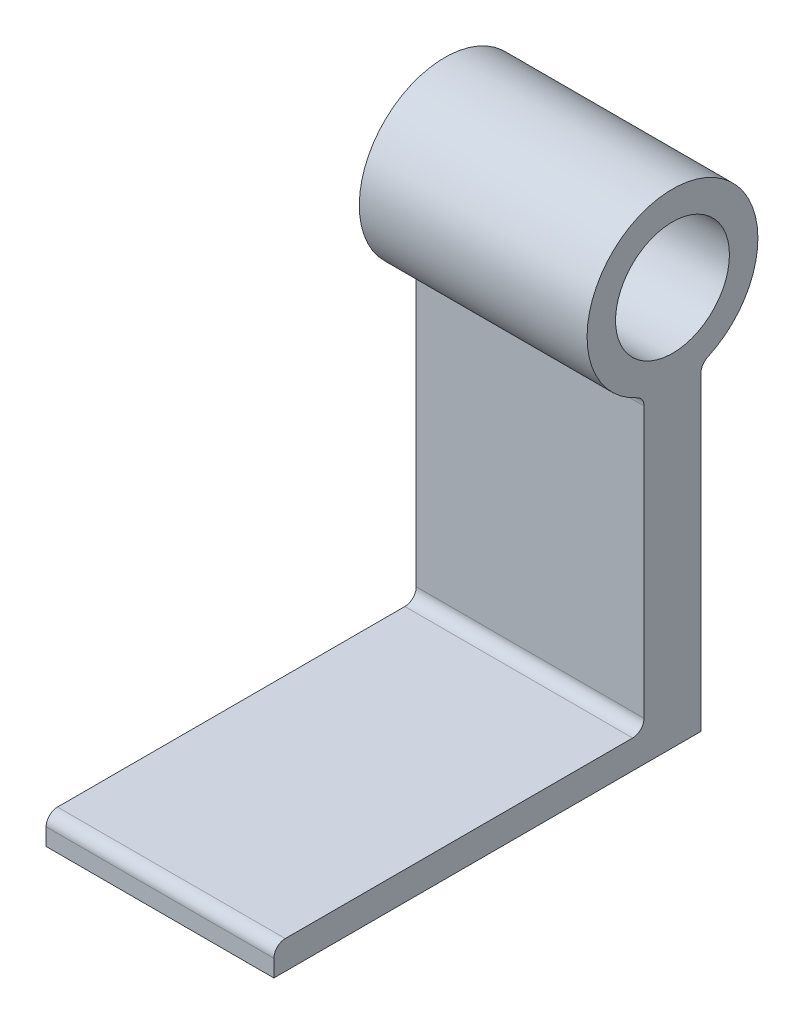
ISO-10303-21;
HEADER;
FILE_DESCRIPTION(('STEP AP214'),'2;1');
FILE_NAME('part.step','',(''),(''),'','','');
FILE_SCHEMA(('AUTOMOTIVE_DESIGN { 1 0 10303 214 1 1 1 1 }'));
ENDSEC;
DATA;
#1=APPLICATION_CONTEXT('core data for automotive mechanical design processes');
#2=APPLICATION_PROTOCOL_DEFINITION('international standard','automotive_design',2000,#1);
#3=PRODUCT_CONTEXT('',#1,'mechanical');
#4=PRODUCT('Part','Part','',(#3));
#5=PRODUCT_RELATED_PRODUCT_CATEGORY('part','',(#4));
#6=PRODUCT_DEFINITION_FORMATION('','',#4);
#7=PRODUCT_DEFINITION_CONTEXT('part definition',#1,'design');
#8=PRODUCT_DEFINITION('design','',#6,#7);
#9=PRODUCT_DEFINITION_SHAPE('','',#8);
#10=(LENGTH_UNIT() NAMED_UNIT(*) SI_UNIT(.MILLI.,.METRE.));
#11=(NAMED_UNIT(*) PLANE_ANGLE_UNIT() SI_UNIT($,.RADIAN.));
#12=(NAMED_UNIT(*) SI_UNIT($,.STERADIAN.) SOLID_ANGLE_UNIT());
#13=UNCERTAINTY_MEASURE_WITH_UNIT(LENGTH_MEASURE(1.E-05),#10,'distance_accuracy_value','');
#14=(GEOMETRIC_REPRESENTATION_CONTEXT(3) GLOBAL_UNCERTAINTY_ASSIGNED_CONTEXT((#13)) GLOBAL_UNIT_ASSIGNED_CONTEXT((#10,
#11,#12)) REPRESENTATION_CONTEXT('',''));
#15=CARTESIAN_POINT('',(0.,0.,0.));
#16=DIRECTION('',(0.,0.,1.));
#17=DIRECTION('',(1.,0.,0.));
#18=AXIS2_PLACEMENT_3D('',#15,#16,#17);
#19=CARTESIAN_POINT('',(50.8,0.,0.));
#20=DIRECTION('',(0.,0.,-1.));
#21=DIRECTION('',(0.,1.,0.));
#22=AXIS2_PLACEMENT_3D('',#19,#20,#21);
#23=PLANE('',#22);
#24=DIRECTION('',(0.,-1.,0.));
#25=VECTOR('',#24,1.);
#26=CARTESIAN_POINT('',(0.,0.,0.));
#27=LINE('',#26,#25);
#28=CARTESIAN_POINT('',(0.,69.2252446012663,0.));
#29=VERTEX_POINT('',#28);
#30=CARTESIAN_POINT('',(0.,0.,0.));
#31=VERTEX_POINT('',#30);
#32=EDGE_CURVE('E145',#29,#31,#27,.T.);
#33=ORIENTED_EDGE('',*,*,#32,.F.);
#34=DIRECTION('',(-1.,0.,0.));
#35=VECTOR('',#34,1.);
#36=CARTESIAN_POINT('',(50.8,69.2252446012663,0.));
#37=LINE('',#36,#35);
#38=CARTESIAN_POINT('',(50.8,69.2252446012663,0.));
#39=VERTEX_POINT('',#38);
#40=EDGE_CURVE('E175',#29,#39,#37,.F.);
#41=ORIENTED_EDGE('',*,*,#40,.T.);
#42=DIRECTION('',(0.,-1.,0.));
#43=VECTOR('',#42,1.);
#44=CARTESIAN_POINT('',(50.8,0.,0.));
#45=LINE('',#44,#43);
#46=CARTESIAN_POINT('',(50.8,0.,0.));
#47=VERTEX_POINT('',#46);
#48=EDGE_CURVE('E161',#39,#47,#45,.T.);
#49=ORIENTED_EDGE('',*,*,#48,.T.);
#50=DIRECTION('',(-1.,0.,0.));
#51=VECTOR('',#50,1.);
#52=CARTESIAN_POINT('',(50.8,0.,0.));
#53=LINE('',#52,#51);
#54=EDGE_CURVE('E125',#47,#31,#53,.T.);
#55=ORIENTED_EDGE('',*,*,#54,.T.);
#56=EDGE_LOOP('',(#33,#41,#49,#55));
#57=FACE_BOUND('',#56,.T.);
#58=ADVANCED_FACE('F38',(#57),#23,.T.);
#59=CARTESIAN_POINT('',(50.8,88.9,6.35));
#60=DIRECTION('',(-1.,0.,0.));
#61=DIRECTION('',(0.,0.,1.));
#62=AXIS2_PLACEMENT_3D('',#59,#60,#61);
#63=CYLINDRICAL_SURFACE('',#62,19.05);
#64=CARTESIAN_POINT('',(50.8,88.9,6.35));
#65=DIRECTION('',(1.,0.,0.));
#66=DIRECTION('',(0.,0.,-1.));
#67=AXIS2_PLACEMENT_3D('',#64,#65,#66);
#68=CIRCLE('',#67,19.05);
#69=CARTESIAN_POINT('',(50.8,71.5399217069997,-1.49411764705882));
#70=VERTEX_POINT('',#69);
#71=CARTESIAN_POINT('',(50.8,71.5399217069997,14.1941176470588));
#72=VERTEX_POINT('',#71);
#73=EDGE_CURVE('E200',#70,#72,#68,.T.);
#74=ORIENTED_EDGE('',*,*,#73,.F.);
#75=DIRECTION('',(-1.,0.,0.));
#76=VECTOR('',#75,1.);
#77=CARTESIAN_POINT('',(50.8,71.5399217069997,-1.49411764705882));
#78=LINE('',#77,#76);
#79=CARTESIAN_POINT('',(0.,71.5399217069997,-1.49411764705882));
#80=VERTEX_POINT('',#79);
#81=EDGE_CURVE('E172',#70,#80,#78,.T.);
#82=ORIENTED_EDGE('',*,*,#81,.T.);
#83=CARTESIAN_POINT('',(0.,88.9,6.35));
#84=DIRECTION('',(1.,0.,0.));
#85=DIRECTION('',(0.,0.,-1.));
#86=AXIS2_PLACEMENT_3D('',#83,#84,#85);
#87=CIRCLE('',#86,19.05);
#88=CARTESIAN_POINT('',(0.,71.5399217069997,14.1941176470588));
#89=VERTEX_POINT('',#88);
#90=EDGE_CURVE('E147',#80,#89,#87,.T.);
#91=ORIENTED_EDGE('',*,*,#90,.T.);
#92=DIRECTION('',(-1.,0.,0.));
#93=VECTOR('',#92,1.);
#94=CARTESIAN_POINT('',(50.8,71.5399217069997,14.1941176470588));
#95=LINE('',#94,#93);
#96=EDGE_CURVE('E170',#89,#72,#95,.F.);
#97=ORIENTED_EDGE('',*,*,#96,.T.);
#98=EDGE_LOOP('',(#74,#82,#91,#97));
#99=FACE_BOUND('',#98,.T.);
#100=ADVANCED_FACE('F225',(#99),#63,.T.);
#101=CARTESIAN_POINT('',(50.8,0.,12.7));
#102=DIRECTION('',(0.,0.,1.));
#103=DIRECTION('',(1.,0.,0.));
#104=AXIS2_PLACEMENT_3D('',#101,#102,#103);
#105=PLANE('',#104);
#106=DIRECTION('',(0.,1.,0.));
#107=VECTOR('',#106,1.);
#108=CARTESIAN_POINT('',(0.,0.,12.7));
#109=LINE('',#108,#107);
#110=CARTESIAN_POINT('',(0.,8.88999999999999,12.7));
#111=VERTEX_POINT('',#110);
#112=CARTESIAN_POINT('',(0.,69.2252446012663,12.7));
#113=VERTEX_POINT('',#112);
#114=EDGE_CURVE('E150',#111,#113,#109,.T.);
#115=ORIENTED_EDGE('',*,*,#114,.F.);
#116=DIRECTION('',(-1.,0.,0.));
#117=VECTOR('',#116,1.);
#118=CARTESIAN_POINT('',(50.8,8.88999999999999,12.7));
#119=LINE('',#118,#117);
#120=CARTESIAN_POINT('',(50.8,8.88999999999999,12.7));
#121=VERTEX_POINT('',#120);
#122=EDGE_CURVE('E168',#111,#121,#119,.F.);
#123=ORIENTED_EDGE('',*,*,#122,.T.);
#124=DIRECTION('',(0.,1.,0.));
#125=VECTOR('',#124,1.);
#126=CARTESIAN_POINT('',(50.8,0.,12.7));
#127=LINE('',#126,#125);
#128=CARTESIAN_POINT('',(50.8,69.2252446012663,12.7));
#129=VERTEX_POINT('',#128);
#130=EDGE_CURVE('E203',#121,#129,#127,.T.);
#131=ORIENTED_EDGE('',*,*,#130,.T.);
#132=DIRECTION('',(-1.,0.,0.));
#133=VECTOR('',#132,1.);
#134=CARTESIAN_POINT('',(50.8,69.2252446012663,12.7));
#135=LINE('',#134,#133);
#136=EDGE_CURVE('E165',#129,#113,#135,.T.);
#137=ORIENTED_EDGE('',*,*,#136,.T.);
#138=EDGE_LOOP('',(#115,#123,#131,#137));
#139=FACE_BOUND('',#138,.T.);
#140=ADVANCED_FACE('F217',(#139),#105,.T.);
#141=CARTESIAN_POINT('',(50.8,6.34999999999999,0.));
#142=DIRECTION('',(0.,1.,0.));
#143=DIRECTION('',(0.,0.,1.));
#144=AXIS2_PLACEMENT_3D('',#141,#142,#143);
#145=PLANE('',#144);
#146=DIRECTION('',(0.,0.,-1.));
#147=VECTOR('',#146,1.);
#148=CARTESIAN_POINT('',(0.,6.34999999999999,0.));
#149=LINE('',#148,#147);
#150=CARTESIAN_POINT('',(0.,6.34999999999999,92.71));
#151=VERTEX_POINT('',#150);
#152=CARTESIAN_POINT('',(0.,6.34999999999999,15.24));
#153=VERTEX_POINT('',#152);
#154=EDGE_CURVE('E153',#151,#153,#149,.T.);
#155=ORIENTED_EDGE('',*,*,#154,.F.);
#156=DIRECTION('',(-1.,0.,0.));
#157=VECTOR('',#156,1.);
#158=CARTESIAN_POINT('',(50.8,6.34999999999999,92.71));
#159=LINE('',#158,#157);
#160=CARTESIAN_POINT('',(50.8,6.34999999999999,92.71));
#161=VERTEX_POINT('',#160);
#162=EDGE_CURVE('E46',#151,#161,#159,.F.);
#163=ORIENTED_EDGE('',*,*,#162,.T.);
#164=DIRECTION('',(0.,0.,-1.));
#165=VECTOR('',#164,1.);
#166=CARTESIAN_POINT('',(50.8,6.34999999999999,0.));
#167=LINE('',#166,#165);
#168=CARTESIAN_POINT('',(50.8,6.34999999999999,15.24));
#169=VERTEX_POINT('',#168);
#170=EDGE_CURVE('E134',#161,#169,#167,.T.);
#171=ORIENTED_EDGE('',*,*,#170,.T.);
#172=DIRECTION('',(-1.,0.,0.));
#173=VECTOR('',#172,1.);
#174=CARTESIAN_POINT('',(0.,6.34999999999999,15.24));
#175=LINE('',#174,#173);
#176=EDGE_CURVE('E124',#169,#153,#175,.T.);
#177=ORIENTED_EDGE('',*,*,#176,.T.);
#178=EDGE_LOOP('',(#155,#163,#171,#177));
#179=FACE_BOUND('',#178,.T.);
#180=ADVANCED_FACE('F207',(#179),#145,.T.);
#181=CARTESIAN_POINT('',(50.8,0.,95.25));
#182=DIRECTION('',(0.,0.,1.));
#183=DIRECTION('',(1.,0.,0.));
#184=AXIS2_PLACEMENT_3D('',#181,#182,#183);
#185=PLANE('',#184);
#186=DIRECTION('',(0.,1.,0.));
#187=VECTOR('',#186,1.);
#188=CARTESIAN_POINT('',(50.8,0.,95.25));
#189=LINE('',#188,#187);
#190=CARTESIAN_POINT('',(50.8,0.,95.25));
#191=VERTEX_POINT('',#190);
#192=CARTESIAN_POINT('',(50.8,3.80999999999999,95.25));
#193=VERTEX_POINT('',#192);
#194=EDGE_CURVE('E117',#191,#193,#189,.T.);
#195=ORIENTED_EDGE('',*,*,#194,.T.);
#196=DIRECTION('',(-1.,0.,0.));
#197=VECTOR('',#196,1.);
#198=CARTESIAN_POINT('',(50.8,3.80999999999999,95.25));
#199=LINE('',#198,#197);
#200=CARTESIAN_POINT('',(0.,3.80999999999999,95.25));
#201=VERTEX_POINT('',#200);
#202=EDGE_CURVE('E190',#193,#201,#199,.T.);
#203=ORIENTED_EDGE('',*,*,#202,.T.);
#204=DIRECTION('',(0.,1.,0.));
#205=VECTOR('',#204,1.);
#206=CARTESIAN_POINT('',(0.,0.,95.25));
#207=LINE('',#206,#205);
#208=CARTESIAN_POINT('',(0.,0.,95.25));
#209=VERTEX_POINT('',#208);
#210=EDGE_CURVE('E119',#209,#201,#207,.T.);
#211=ORIENTED_EDGE('',*,*,#210,.F.);
#212=DIRECTION('',(-1.,0.,0.));
#213=VECTOR('',#212,1.);
#214=CARTESIAN_POINT('',(50.8,0.,95.25));
#215=LINE('',#214,#213);
#216=EDGE_CURVE('E113',#191,#209,#215,.T.);
#217=ORIENTED_EDGE('',*,*,#216,.F.);
#218=EDGE_LOOP('',(#195,#203,#211,#217));
#219=FACE_BOUND('',#218,.T.);
#220=ADVANCED_FACE('F115',(#219),#185,.T.);
#221=CARTESIAN_POINT('',(50.8,0.,0.));
#222=DIRECTION('',(0.,-1.,0.));
#223=DIRECTION('',(0.,0.,-1.));
#224=AXIS2_PLACEMENT_3D('',#221,#222,#223);
#225=PLANE('',#224);
#226=DIRECTION('',(0.,0.,1.));
#227=VECTOR('',#226,1.);
#228=CARTESIAN_POINT('',(0.,0.,0.));
#229=LINE('',#228,#227);
#230=EDGE_CURVE('E156',#31,#209,#229,.T.);
#231=ORIENTED_EDGE('',*,*,#230,.F.);
#232=ORIENTED_EDGE('',*,*,#54,.F.);
#233=DIRECTION('',(0.,0.,1.));
#234=VECTOR('',#233,1.);
#235=CARTESIAN_POINT('',(50.8,0.,0.));
#236=LINE('',#235,#234);
#237=EDGE_CURVE('E132',#47,#191,#236,.T.);
#238=ORIENTED_EDGE('',*,*,#237,.T.);
#239=ORIENTED_EDGE('',*,*,#216,.T.);
#240=EDGE_LOOP('',(#231,#232,#238,#239));
#241=FACE_BOUND('',#240,.T.);
#242=ADVANCED_FACE('F137',(#241),#225,.T.);
#243=CARTESIAN_POINT('',(50.8,88.9,6.35));
#244=DIRECTION('',(-1.,0.,0.));
#245=DIRECTION('',(0.,0.,1.));
#246=AXIS2_PLACEMENT_3D('',#243,#244,#245);
#247=CYLINDRICAL_SURFACE('',#246,12.7);
#248=CARTESIAN_POINT('',(50.8,88.9,6.35));
#249=DIRECTION('',(1.,0.,0.));
#250=DIRECTION('',(0.,0.,-1.));
#251=AXIS2_PLACEMENT_3D('',#248,#249,#250);
#252=CIRCLE('',#251,12.7);
#253=CARTESIAN_POINT('',(50.8,88.9,-6.35));
#254=VERTEX_POINT('',#253);
#255=EDGE_CURVE('E139',#254,#254,#252,.T.);
#256=ORIENTED_EDGE('',*,*,#255,.T.);
#257=EDGE_LOOP('',(#256));
#258=FACE_BOUND('',#257,.T.);
#259=CARTESIAN_POINT('',(0.,88.9,6.35));
#260=DIRECTION('',(1.,0.,0.));
#261=DIRECTION('',(0.,0.,-1.));
#262=AXIS2_PLACEMENT_3D('',#259,#260,#261);
#263=CIRCLE('',#262,12.7);
#264=CARTESIAN_POINT('',(0.,88.9,-6.35));
#265=VERTEX_POINT('',#264);
#266=EDGE_CURVE('E158',#265,#265,#263,.T.);
#267=ORIENTED_EDGE('',*,*,#266,.F.);
#268=EDGE_LOOP('',(#267));
#269=FACE_BOUND('',#268,.T.);
#270=ADVANCED_FACE('F251',(#258,#269),#247,.F.);
#271=CARTESIAN_POINT('',(50.8,0.,0.));
#272=DIRECTION('',(1.,0.,0.));
#273=DIRECTION('',(0.,0.,-1.));
#274=AXIS2_PLACEMENT_3D('',#271,#272,#273);
#275=PLANE('',#274);
#276=ORIENTED_EDGE('',*,*,#170,.F.);
#277=CARTESIAN_POINT('',(50.8,3.80999999999999,92.71));
#278=DIRECTION('',(1.,0.,0.));
#279=DIRECTION('',(0.,0.,-1.));
#280=AXIS2_PLACEMENT_3D('',#277,#278,#279);
#281=CIRCLE('',#280,2.54);
#282=EDGE_CURVE('E11',#161,#193,#281,.T.);
#283=ORIENTED_EDGE('',*,*,#282,.T.);
#284=ORIENTED_EDGE('',*,*,#194,.F.);
#285=ORIENTED_EDGE('',*,*,#237,.F.);
#286=ORIENTED_EDGE('',*,*,#48,.F.);
#287=CARTESIAN_POINT('',(50.8,69.2252446012663,-2.54));
#288=DIRECTION('',(1.,0.,0.));
#289=DIRECTION('',(0.,0.,-1.));
#290=AXIS2_PLACEMENT_3D('',#287,#288,#289);
#291=CIRCLE('',#290,2.54);
#292=EDGE_CURVE('E184',#39,#70,#291,.F.);
#293=ORIENTED_EDGE('',*,*,#292,.T.);
#294=ORIENTED_EDGE('',*,*,#73,.T.);
#295=CARTESIAN_POINT('',(50.8,69.2252446012663,15.24));
#296=DIRECTION('',(1.,0.,0.));
#297=DIRECTION('',(0.,0.,-1.));
#298=AXIS2_PLACEMENT_3D('',#295,#296,#297);
#299=CIRCLE('',#298,2.54);
#300=EDGE_CURVE('E188',#72,#129,#299,.F.);
#301=ORIENTED_EDGE('',*,*,#300,.T.);
#302=ORIENTED_EDGE('',*,*,#130,.F.);
#303=CARTESIAN_POINT('',(50.8,8.88999999999999,15.24));
#304=DIRECTION('',(1.,0.,0.));
#305=DIRECTION('',(0.,0.,-1.));
#306=AXIS2_PLACEMENT_3D('',#303,#304,#305);
#307=CIRCLE('',#306,2.54);
#308=EDGE_CURVE('E179',#121,#169,#307,.F.);
#309=ORIENTED_EDGE('',*,*,#308,.T.);
#310=EDGE_LOOP('',(#276,#283,#284,#285,#286,#293,#294,#301,#302,#309));
#311=FACE_BOUND('',#310,.T.);
#312=ORIENTED_EDGE('',*,*,#255,.F.);
#313=EDGE_LOOP('',(#312));
#314=FACE_BOUND('',#313,.T.);
#315=ADVANCED_FACE('F129',(#311,#314),#275,.T.);
#316=CARTESIAN_POINT('',(0.,0.,0.));
#317=DIRECTION('',(1.,0.,0.));
#318=DIRECTION('',(0.,0.,-1.));
#319=AXIS2_PLACEMENT_3D('',#316,#317,#318);
#320=PLANE('',#319);
#321=ORIENTED_EDGE('',*,*,#210,.T.);
#322=CARTESIAN_POINT('',(0.,3.80999999999999,92.71));
#323=DIRECTION('',(1.,0.,0.));
#324=DIRECTION('',(0.,0.,-1.));
#325=AXIS2_PLACEMENT_3D('',#322,#323,#324);
#326=CIRCLE('',#325,2.54);
#327=EDGE_CURVE('E60',#201,#151,#326,.F.);
#328=ORIENTED_EDGE('',*,*,#327,.T.);
#329=ORIENTED_EDGE('',*,*,#154,.T.);
#330=CARTESIAN_POINT('',(0.,8.88999999999999,15.24));
#331=DIRECTION('',(1.,0.,0.));
#332=DIRECTION('',(0.,0.,-1.));
#333=AXIS2_PLACEMENT_3D('',#330,#331,#332);
#334=CIRCLE('',#333,2.54);
#335=EDGE_CURVE('E177',#153,#111,#334,.T.);
#336=ORIENTED_EDGE('',*,*,#335,.T.);
#337=ORIENTED_EDGE('',*,*,#114,.T.);
#338=CARTESIAN_POINT('',(0.,69.2252446012663,15.24));
#339=DIRECTION('',(1.,0.,0.));
#340=DIRECTION('',(0.,0.,-1.));
#341=AXIS2_PLACEMENT_3D('',#338,#339,#340);
#342=CIRCLE('',#341,2.54);
#343=EDGE_CURVE('E186',#113,#89,#342,.T.);
#344=ORIENTED_EDGE('',*,*,#343,.T.);
#345=ORIENTED_EDGE('',*,*,#90,.F.);
#346=CARTESIAN_POINT('',(0.,69.2252446012663,-2.54));
#347=DIRECTION('',(1.,0.,0.));
#348=DIRECTION('',(0.,0.,-1.));
#349=AXIS2_PLACEMENT_3D('',#346,#347,#348);
#350=CIRCLE('',#349,2.54);
#351=EDGE_CURVE('E182',#80,#29,#350,.T.);
#352=ORIENTED_EDGE('',*,*,#351,.T.);
#353=ORIENTED_EDGE('',*,*,#32,.T.);
#354=ORIENTED_EDGE('',*,*,#230,.T.);
#355=EDGE_LOOP('',(#321,#328,#329,#336,#337,#344,#345,#352,#353,#354));
#356=FACE_BOUND('',#355,.T.);
#357=ORIENTED_EDGE('',*,*,#266,.T.);
#358=EDGE_LOOP('',(#357));
#359=FACE_BOUND('',#358,.T.);
#360=ADVANCED_FACE('F193',(#356,#359),#320,.F.);
#361=CARTESIAN_POINT('',(50.8,8.88999999999999,15.24));
#362=DIRECTION('',(1.,0.,0.));
#363=DIRECTION('',(0.,0.,-1.));
#364=AXIS2_PLACEMENT_3D('',#361,#362,#363);
#365=CYLINDRICAL_SURFACE('',#364,2.54);
#366=ORIENTED_EDGE('',*,*,#308,.F.);
#367=ORIENTED_EDGE('',*,*,#122,.F.);
#368=ORIENTED_EDGE('',*,*,#335,.F.);
#369=ORIENTED_EDGE('',*,*,#176,.F.);
#370=EDGE_LOOP('',(#366,#367,#368,#369));
#371=FACE_BOUND('',#370,.T.);
#372=ADVANCED_FACE('F214',(#371),#365,.F.);
#373=CARTESIAN_POINT('',(50.8,69.2252446012663,-2.54));
#374=DIRECTION('',(-1.,0.,0.));
#375=DIRECTION('',(0.,0.,1.));
#376=AXIS2_PLACEMENT_3D('',#373,#374,#375);
#377=CYLINDRICAL_SURFACE('',#376,2.54);
#378=ORIENTED_EDGE('',*,*,#292,.F.);
#379=ORIENTED_EDGE('',*,*,#40,.F.);
#380=ORIENTED_EDGE('',*,*,#351,.F.);
#381=ORIENTED_EDGE('',*,*,#81,.F.);
#382=EDGE_LOOP('',(#378,#379,#380,#381));
#383=FACE_BOUND('',#382,.T.);
#384=ADVANCED_FACE('F228',(#383),#377,.F.);
#385=CARTESIAN_POINT('',(50.8,69.2252446012663,15.24));
#386=DIRECTION('',(-1.,0.,0.));
#387=DIRECTION('',(0.,0.,1.));
#388=AXIS2_PLACEMENT_3D('',#385,#386,#387);
#389=CYLINDRICAL_SURFACE('',#388,2.54);
#390=ORIENTED_EDGE('',*,*,#300,.F.);
#391=ORIENTED_EDGE('',*,*,#96,.F.);
#392=ORIENTED_EDGE('',*,*,#343,.F.);
#393=ORIENTED_EDGE('',*,*,#136,.F.);
#394=EDGE_LOOP('',(#390,#391,#392,#393));
#395=FACE_BOUND('',#394,.T.);
#396=ADVANCED_FACE('F221',(#395),#389,.F.);
#397=CARTESIAN_POINT('',(50.8,3.80999999999999,92.71));
#398=DIRECTION('',(-1.,0.,0.));
#399=DIRECTION('',(0.,0.,1.));
#400=AXIS2_PLACEMENT_3D('',#397,#398,#399);
#401=CYLINDRICAL_SURFACE('',#400,2.54);
#402=ORIENTED_EDGE('',*,*,#282,.F.);
#403=ORIENTED_EDGE('',*,*,#162,.F.);
#404=ORIENTED_EDGE('',*,*,#327,.F.);
#405=ORIENTED_EDGE('',*,*,#202,.F.);
#406=EDGE_LOOP('',(#402,#403,#404,#405));
#407=FACE_BOUND('',#406,.T.);
#408=ADVANCED_FACE('F40',(#407),#401,.T.);
#409=CLOSED_SHELL('',(#58,#100,#140,#180,#220,#242,#270,#315,#360,#372,#384,#396,#408));
#410=MANIFOLD_SOLID_BREP('B2',#409);
#411=ADVANCED_BREP_SHAPE_REPRESENTATION('',(#18,#410),#14);
#412=SHAPE_DEFINITION_REPRESENTATION(#9,#411);
ENDSEC;
END-ISO-10303-21;
